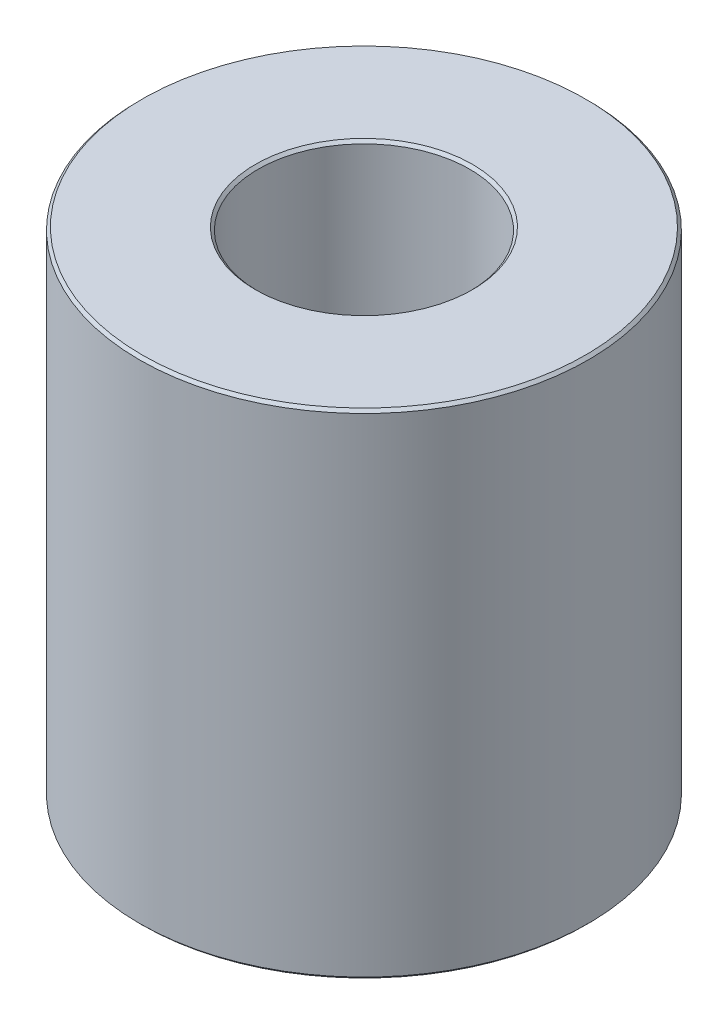
ISO-10303-21;
HEADER;
FILE_DESCRIPTION(('STEP AP214'),'2;1');
FILE_NAME('part.step','',(''),(''),'','','');
FILE_SCHEMA(('AUTOMOTIVE_DESIGN { 1 0 10303 214 1 1 1 1 }'));
ENDSEC;
DATA;
#1=APPLICATION_CONTEXT('core data for automotive mechanical design processes');
#2=APPLICATION_PROTOCOL_DEFINITION('international standard','automotive_design',2000,#1);
#3=PRODUCT_CONTEXT('',#1,'mechanical');
#4=PRODUCT('Part','Part','',(#3));
#5=PRODUCT_RELATED_PRODUCT_CATEGORY('part','',(#4));
#6=PRODUCT_DEFINITION_FORMATION('','',#4);
#7=PRODUCT_DEFINITION_CONTEXT('part definition',#1,'design');
#8=PRODUCT_DEFINITION('design','',#6,#7);
#9=PRODUCT_DEFINITION_SHAPE('','',#8);
#10=(LENGTH_UNIT() NAMED_UNIT(*) SI_UNIT(.MILLI.,.METRE.));
#11=(NAMED_UNIT(*) PLANE_ANGLE_UNIT() SI_UNIT($,.RADIAN.));
#12=(NAMED_UNIT(*) SI_UNIT($,.STERADIAN.) SOLID_ANGLE_UNIT());
#13=UNCERTAINTY_MEASURE_WITH_UNIT(LENGTH_MEASURE(1.E-05),#10,'distance_accuracy_value','');
#14=(GEOMETRIC_REPRESENTATION_CONTEXT(3) GLOBAL_UNCERTAINTY_ASSIGNED_CONTEXT((#13)) GLOBAL_UNIT_ASSIGNED_CONTEXT((#10,
#11,#12)) REPRESENTATION_CONTEXT('',''));
#15=CARTESIAN_POINT('',(0.,0.,0.));
#16=DIRECTION('',(0.,0.,1.));
#17=DIRECTION('',(1.,0.,0.));
#18=AXIS2_PLACEMENT_3D('',#15,#16,#17);
#19=CARTESIAN_POINT('',(0.,54.9739554033674,0.));
#20=DIRECTION('',(0.,-1.,0.));
#21=DIRECTION('',(0.,0.,-1.));
#22=AXIS2_PLACEMENT_3D('',#19,#20,#21);
#23=CYLINDRICAL_SURFACE('',#22,25.);
#24=CARTESIAN_POINT('',(0.,0.309520692201047,0.));
#25=DIRECTION('',(0.,1.,0.));
#26=DIRECTION('',(0.,0.,1.));
#27=AXIS2_PLACEMENT_3D('',#24,#25,#26);
#28=CIRCLE('',#27,25.);
#29=CARTESIAN_POINT('',(0.,0.309520692201047,25.));
#30=VERTEX_POINT('',#29);
#31=EDGE_CURVE('E10',#30,#30,#28,.T.);
#32=ORIENTED_EDGE('',*,*,#31,.T.);
#33=EDGE_LOOP('',(#32));
#34=FACE_BOUND('',#33,.T.);
#35=CARTESIAN_POINT('',(0.,54.6644347111664,0.));
#36=DIRECTION('',(0.,1.,0.));
#37=DIRECTION('',(0.,0.,1.));
#38=AXIS2_PLACEMENT_3D('',#35,#36,#37);
#39=CIRCLE('',#38,25.);
#40=CARTESIAN_POINT('',(0.,54.6644347111664,25.));
#41=VERTEX_POINT('',#40);
#42=EDGE_CURVE('E50',#41,#41,#39,.F.);
#43=ORIENTED_EDGE('',*,*,#42,.T.);
#44=EDGE_LOOP('',(#43));
#45=FACE_BOUND('',#44,.T.);
#46=ADVANCED_FACE('F39',(#34,#45),#23,.T.);
#47=CARTESIAN_POINT('',(0.,54.9739554033674,0.));
#48=DIRECTION('',(0.,1.,0.));
#49=DIRECTION('',(0.,0.,1.));
#50=AXIS2_PLACEMENT_3D('',#47,#48,#49);
#51=PLANE('',#50);
#52=CARTESIAN_POINT('',(0.,54.9739554033674,0.));
#53=DIRECTION('',(0.,1.,0.));
#54=DIRECTION('',(0.,0.,1.));
#55=AXIS2_PLACEMENT_3D('',#52,#53,#54);
#56=CIRCLE('',#55,12.0931570105148);
#57=CARTESIAN_POINT('',(0.,54.9739554033674,12.0931570105148));
#58=VERTEX_POINT('',#57);
#59=EDGE_CURVE('E58',#58,#58,#56,.F.);
#60=ORIENTED_EDGE('',*,*,#59,.T.);
#61=EDGE_LOOP('',(#60));
#62=FACE_BOUND('',#61,.T.);
#63=CARTESIAN_POINT('',(0.,54.9739554033674,0.));
#64=DIRECTION('',(0.,1.,0.));
#65=DIRECTION('',(0.,0.,1.));
#66=AXIS2_PLACEMENT_3D('',#63,#64,#65);
#67=CIRCLE('',#66,24.6904793077989);
#68=CARTESIAN_POINT('',(0.,54.9739554033674,24.6904793077989));
#69=VERTEX_POINT('',#68);
#70=EDGE_CURVE('E61',#69,#69,#67,.T.);
#71=ORIENTED_EDGE('',*,*,#70,.T.);
#72=EDGE_LOOP('',(#71));
#73=FACE_BOUND('',#72,.T.);
#74=ADVANCED_FACE('F88',(#62,#73),#51,.T.);
#75=CARTESIAN_POINT('',(0.,0.,0.));
#76=DIRECTION('',(0.,1.,0.));
#77=DIRECTION('',(0.,0.,1.));
#78=AXIS2_PLACEMENT_3D('',#75,#76,#77);
#79=PLANE('',#78);
#80=CARTESIAN_POINT('',(0.,0.,0.));
#81=DIRECTION('',(0.,1.,0.));
#82=DIRECTION('',(0.,0.,1.));
#83=AXIS2_PLACEMENT_3D('',#80,#81,#82);
#84=CIRCLE('',#83,12.0931570105148);
#85=CARTESIAN_POINT('',(0.,0.,12.0931570105148));
#86=VERTEX_POINT('',#85);
#87=EDGE_CURVE('E51',#86,#86,#84,.T.);
#88=ORIENTED_EDGE('',*,*,#87,.T.);
#89=EDGE_LOOP('',(#88));
#90=FACE_BOUND('',#89,.T.);
#91=CARTESIAN_POINT('',(0.,0.,0.));
#92=DIRECTION('',(0.,1.,0.));
#93=DIRECTION('',(0.,0.,1.));
#94=AXIS2_PLACEMENT_3D('',#91,#92,#93);
#95=CIRCLE('',#94,24.690479307799);
#96=CARTESIAN_POINT('',(0.,0.,24.690479307799));
#97=VERTEX_POINT('',#96);
#98=EDGE_CURVE('E54',#97,#97,#95,.F.);
#99=ORIENTED_EDGE('',*,*,#98,.T.);
#100=EDGE_LOOP('',(#99));
#101=FACE_BOUND('',#100,.T.);
#102=ADVANCED_FACE('F83',(#90,#101),#79,.F.);
#103=CARTESIAN_POINT('',(0.,54.9739554033674,0.));
#104=DIRECTION('',(0.,-1.,0.));
#105=DIRECTION('',(0.,0.,-1.));
#106=AXIS2_PLACEMENT_3D('',#103,#104,#105);
#107=CYLINDRICAL_SURFACE('',#106,11.7836363183137);
#108=CARTESIAN_POINT('',(0.,54.6644347111664,0.));
#109=DIRECTION('',(0.,1.,0.));
#110=DIRECTION('',(0.,0.,1.));
#111=AXIS2_PLACEMENT_3D('',#108,#109,#110);
#112=CIRCLE('',#111,11.7836363183137);
#113=CARTESIAN_POINT('',(0.,54.6644347111664,11.7836363183137));
#114=VERTEX_POINT('',#113);
#115=EDGE_CURVE('E67',#114,#114,#112,.T.);
#116=ORIENTED_EDGE('',*,*,#115,.T.);
#117=EDGE_LOOP('',(#116));
#118=FACE_BOUND('',#117,.T.);
#119=CARTESIAN_POINT('',(0.,0.30952069220104,0.));
#120=DIRECTION('',(0.,1.,0.));
#121=DIRECTION('',(0.,0.,1.));
#122=AXIS2_PLACEMENT_3D('',#119,#120,#121);
#123=CIRCLE('',#122,11.7836363183137);
#124=CARTESIAN_POINT('',(0.,0.30952069220104,11.7836363183137));
#125=VERTEX_POINT('',#124);
#126=EDGE_CURVE('E69',#125,#125,#123,.F.);
#127=ORIENTED_EDGE('',*,*,#126,.T.);
#128=EDGE_LOOP('',(#127));
#129=FACE_BOUND('',#128,.T.);
#130=ADVANCED_FACE('F71',(#118,#129),#107,.F.);
#131=CARTESIAN_POINT('',(0.,54.6644347111664,0.));
#132=DIRECTION('',(0.,1.,0.));
#133=DIRECTION('',(0.,0.,1.));
#134=AXIS2_PLACEMENT_3D('',#131,#132,#133);
#135=CONICAL_SURFACE('',#134,11.7836363183137,0.785398163397454);
#136=ORIENTED_EDGE('',*,*,#59,.F.);
#137=EDGE_LOOP('',(#136));
#138=FACE_BOUND('',#137,.T.);
#139=ORIENTED_EDGE('',*,*,#115,.F.);
#140=EDGE_LOOP('',(#139));
#141=FACE_BOUND('',#140,.T.);
#142=ADVANCED_FACE('F77',(#138,#141),#135,.F.);
#143=CARTESIAN_POINT('',(0.,0.,0.));
#144=DIRECTION('',(0.,-1.,0.));
#145=DIRECTION('',(0.,0.,-1.));
#146=AXIS2_PLACEMENT_3D('',#143,#144,#145);
#147=CONICAL_SURFACE('',#146,12.0931570105148,0.785398163397443);
#148=ORIENTED_EDGE('',*,*,#126,.F.);
#149=EDGE_LOOP('',(#148));
#150=FACE_BOUND('',#149,.T.);
#151=ORIENTED_EDGE('',*,*,#87,.F.);
#152=EDGE_LOOP('',(#151));
#153=FACE_BOUND('',#152,.T.);
#154=ADVANCED_FACE('F73',(#150,#153),#147,.F.);
#155=CARTESIAN_POINT('',(0.,0.309520692201047,0.));
#156=DIRECTION('',(0.,1.,0.));
#157=DIRECTION('',(0.,0.,1.));
#158=AXIS2_PLACEMENT_3D('',#155,#156,#157);
#159=CONICAL_SURFACE('',#158,25.,0.785398163397432);
#160=ORIENTED_EDGE('',*,*,#98,.F.);
#161=EDGE_LOOP('',(#160));
#162=FACE_BOUND('',#161,.T.);
#163=ORIENTED_EDGE('',*,*,#31,.F.);
#164=EDGE_LOOP('',(#163));
#165=FACE_BOUND('',#164,.T.);
#166=ADVANCED_FACE('F76',(#162,#165),#159,.T.);
#167=CARTESIAN_POINT('',(0.,54.9739554033674,0.));
#168=DIRECTION('',(0.,-1.,0.));
#169=DIRECTION('',(0.,0.,-1.));
#170=AXIS2_PLACEMENT_3D('',#167,#168,#169);
#171=CONICAL_SURFACE('',#170,24.6904793077989,0.785398163397437);
#172=ORIENTED_EDGE('',*,*,#42,.F.);
#173=EDGE_LOOP('',(#172));
#174=FACE_BOUND('',#173,.T.);
#175=ORIENTED_EDGE('',*,*,#70,.F.);
#176=EDGE_LOOP('',(#175));
#177=FACE_BOUND('',#176,.T.);
#178=ADVANCED_FACE('F45',(#174,#177),#171,.T.);
#179=CLOSED_SHELL('',(#46,#74,#102,#130,#142,#154,#166,#178));
#180=MANIFOLD_SOLID_BREP('B2',#179);
#181=ADVANCED_BREP_SHAPE_REPRESENTATION('',(#18,#180),#14);
#182=SHAPE_DEFINITION_REPRESENTATION(#9,#181);
ENDSEC;
END-ISO-10303-21;
